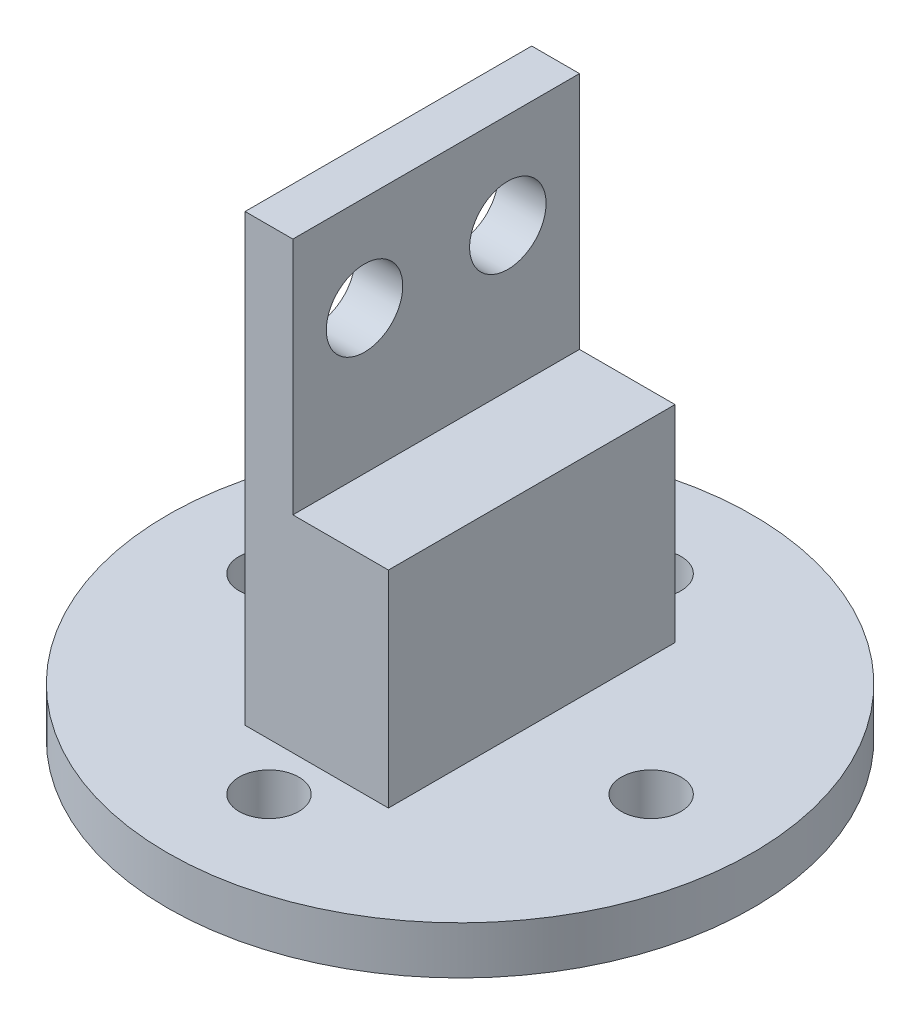
ISO-10303-21;
HEADER;
FILE_DESCRIPTION(('STEP AP214'),'2;1');
FILE_NAME('part.step','',(''),(''),'','','');
FILE_SCHEMA(('AUTOMOTIVE_DESIGN { 1 0 10303 214 1 1 1 1 }'));
ENDSEC;
DATA;
#1=APPLICATION_CONTEXT('core data for automotive mechanical design processes');
#2=APPLICATION_PROTOCOL_DEFINITION('international standard','automotive_design',2000,#1);
#3=PRODUCT_CONTEXT('',#1,'mechanical');
#4=PRODUCT('Part','Part','',(#3));
#5=PRODUCT_RELATED_PRODUCT_CATEGORY('part','',(#4));
#6=PRODUCT_DEFINITION_FORMATION('','',#4);
#7=PRODUCT_DEFINITION_CONTEXT('part definition',#1,'design');
#8=PRODUCT_DEFINITION('design','',#6,#7);
#9=PRODUCT_DEFINITION_SHAPE('','',#8);
#10=(LENGTH_UNIT() NAMED_UNIT(*) SI_UNIT(.MILLI.,.METRE.));
#11=(NAMED_UNIT(*) PLANE_ANGLE_UNIT() SI_UNIT($,.RADIAN.));
#12=(NAMED_UNIT(*) SI_UNIT($,.STERADIAN.) SOLID_ANGLE_UNIT());
#13=UNCERTAINTY_MEASURE_WITH_UNIT(LENGTH_MEASURE(1.E-05),#10,'distance_accuracy_value','');
#14=(GEOMETRIC_REPRESENTATION_CONTEXT(3) GLOBAL_UNCERTAINTY_ASSIGNED_CONTEXT((#13)) GLOBAL_UNIT_ASSIGNED_CONTEXT((#10,
#11,#12)) REPRESENTATION_CONTEXT('',''));
#15=CARTESIAN_POINT('',(0.,0.,0.));
#16=DIRECTION('',(0.,0.,1.));
#17=DIRECTION('',(1.,0.,0.));
#18=AXIS2_PLACEMENT_3D('',#15,#16,#17);
#19=CARTESIAN_POINT('',(0.,2.,0.));
#20=DIRECTION('',(0.,1.,0.));
#21=DIRECTION('',(0.,0.,1.));
#22=AXIS2_PLACEMENT_3D('',#19,#20,#21);
#23=PLANE('',#22);
#24=CARTESIAN_POINT('',(-8.,2.,0.));
#25=DIRECTION('',(0.,1.,0.));
#26=DIRECTION('',(0.,0.,1.));
#27=AXIS2_PLACEMENT_3D('',#24,#25,#26);
#28=CIRCLE('',#27,1.25);
#29=CARTESIAN_POINT('',(-8.,2.,1.24999999999994));
#30=VERTEX_POINT('',#29);
#31=EDGE_CURVE('E182',#30,#30,#28,.T.);
#32=ORIENTED_EDGE('',*,*,#31,.F.);
#33=EDGE_LOOP('',(#32));
#34=FACE_BOUND('',#33,.T.);
#35=CARTESIAN_POINT('',(8.,2.,0.));
#36=DIRECTION('',(0.,1.,0.));
#37=DIRECTION('',(0.,0.,1.));
#38=AXIS2_PLACEMENT_3D('',#35,#36,#37);
#39=CIRCLE('',#38,1.25);
#40=CARTESIAN_POINT('',(8.,2.,1.25));
#41=VERTEX_POINT('',#40);
#42=EDGE_CURVE('E198',#41,#41,#39,.T.);
#43=ORIENTED_EDGE('',*,*,#42,.F.);
#44=EDGE_LOOP('',(#43));
#45=FACE_BOUND('',#44,.T.);
#46=CARTESIAN_POINT('',(0.,2.,0.));
#47=DIRECTION('',(0.,1.,0.));
#48=DIRECTION('',(0.,0.,1.));
#49=AXIS2_PLACEMENT_3D('',#46,#47,#48);
#50=CIRCLE('',#49,12.25);
#51=CARTESIAN_POINT('',(0.,2.,12.25));
#52=VERTEX_POINT('',#51);
#53=EDGE_CURVE('E11',#52,#52,#50,.T.);
#54=ORIENTED_EDGE('',*,*,#53,.T.);
#55=EDGE_LOOP('',(#54));
#56=FACE_BOUND('',#55,.T.);
#57=CARTESIAN_POINT('',(0.,2.,8.));
#58=DIRECTION('',(0.,1.,0.));
#59=DIRECTION('',(0.,0.,1.));
#60=AXIS2_PLACEMENT_3D('',#57,#58,#59);
#61=CIRCLE('',#60,1.25);
#62=CARTESIAN_POINT('',(0.,2.,9.25));
#63=VERTEX_POINT('',#62);
#64=EDGE_CURVE('E190',#63,#63,#61,.T.);
#65=ORIENTED_EDGE('',*,*,#64,.F.);
#66=EDGE_LOOP('',(#65));
#67=FACE_BOUND('',#66,.T.);
#68=CARTESIAN_POINT('',(0.,2.,-8.));
#69=DIRECTION('',(0.,1.,0.));
#70=DIRECTION('',(0.,0.,1.));
#71=AXIS2_PLACEMENT_3D('',#68,#69,#70);
#72=CIRCLE('',#71,1.25);
#73=CARTESIAN_POINT('',(0.,2.,-6.75));
#74=VERTEX_POINT('',#73);
#75=EDGE_CURVE('E174',#74,#74,#72,.T.);
#76=ORIENTED_EDGE('',*,*,#75,.F.);
#77=EDGE_LOOP('',(#76));
#78=FACE_BOUND('',#77,.T.);
#79=DIRECTION('',(0.,0.,1.));
#80=VECTOR('',#79,1.);
#81=CARTESIAN_POINT('',(-3.,2.,6.));
#82=LINE('',#81,#80);
#83=CARTESIAN_POINT('',(-3.,2.,-6.));
#84=VERTEX_POINT('',#83);
#85=CARTESIAN_POINT('',(-3.,2.,6.));
#86=VERTEX_POINT('',#85);
#87=EDGE_CURVE('E130',#84,#86,#82,.T.);
#88=ORIENTED_EDGE('',*,*,#87,.F.);
#89=DIRECTION('',(-1.,0.,0.));
#90=VECTOR('',#89,1.);
#91=CARTESIAN_POINT('',(-3.,2.,-6.));
#92=LINE('',#91,#90);
#93=CARTESIAN_POINT('',(3.,2.,-6.));
#94=VERTEX_POINT('',#93);
#95=EDGE_CURVE('E126',#94,#84,#92,.T.);
#96=ORIENTED_EDGE('',*,*,#95,.F.);
#97=DIRECTION('',(0.,0.,-1.));
#98=VECTOR('',#97,1.);
#99=CARTESIAN_POINT('',(3.,2.,-6.));
#100=LINE('',#99,#98);
#101=CARTESIAN_POINT('',(3.,2.,6.));
#102=VERTEX_POINT('',#101);
#103=EDGE_CURVE('E137',#102,#94,#100,.T.);
#104=ORIENTED_EDGE('',*,*,#103,.F.);
#105=DIRECTION('',(1.,0.,0.));
#106=VECTOR('',#105,1.);
#107=CARTESIAN_POINT('',(-3.,2.,6.));
#108=LINE('',#107,#106);
#109=EDGE_CURVE('E134',#86,#102,#108,.T.);
#110=ORIENTED_EDGE('',*,*,#109,.F.);
#111=EDGE_LOOP('',(#88,#96,#104,#110));
#112=FACE_BOUND('',#111,.T.);
#113=ADVANCED_FACE('F38',(#34,#45,#56,#67,#78,#112),#23,.T.);
#114=CARTESIAN_POINT('',(0.,0.,0.));
#115=DIRECTION('',(0.,1.,0.));
#116=DIRECTION('',(0.,0.,1.));
#117=AXIS2_PLACEMENT_3D('',#114,#115,#116);
#118=PLANE('',#117);
#119=CARTESIAN_POINT('',(0.,0.,0.));
#120=DIRECTION('',(0.,1.,0.));
#121=DIRECTION('',(0.,0.,1.));
#122=AXIS2_PLACEMENT_3D('',#119,#120,#121);
#123=CIRCLE('',#122,12.25);
#124=CARTESIAN_POINT('',(0.,0.,12.25));
#125=VERTEX_POINT('',#124);
#126=EDGE_CURVE('E48',#125,#125,#123,.T.);
#127=ORIENTED_EDGE('',*,*,#126,.F.);
#128=EDGE_LOOP('',(#127));
#129=FACE_BOUND('',#128,.T.);
#130=CARTESIAN_POINT('',(8.,0.,0.));
#131=DIRECTION('',(0.,1.,0.));
#132=DIRECTION('',(0.,0.,1.));
#133=AXIS2_PLACEMENT_3D('',#130,#131,#132);
#134=CIRCLE('',#133,1.25);
#135=CARTESIAN_POINT('',(8.,0.,1.25));
#136=VERTEX_POINT('',#135);
#137=EDGE_CURVE('E194',#136,#136,#134,.T.);
#138=ORIENTED_EDGE('',*,*,#137,.T.);
#139=EDGE_LOOP('',(#138));
#140=FACE_BOUND('',#139,.T.);
#141=CARTESIAN_POINT('',(0.,0.,8.));
#142=DIRECTION('',(0.,1.,0.));
#143=DIRECTION('',(0.,0.,1.));
#144=AXIS2_PLACEMENT_3D('',#141,#142,#143);
#145=CIRCLE('',#144,1.25);
#146=CARTESIAN_POINT('',(0.,0.,9.25));
#147=VERTEX_POINT('',#146);
#148=EDGE_CURVE('E186',#147,#147,#145,.T.);
#149=ORIENTED_EDGE('',*,*,#148,.T.);
#150=EDGE_LOOP('',(#149));
#151=FACE_BOUND('',#150,.T.);
#152=CARTESIAN_POINT('',(-8.,0.,0.));
#153=DIRECTION('',(0.,1.,0.));
#154=DIRECTION('',(0.,0.,1.));
#155=AXIS2_PLACEMENT_3D('',#152,#153,#154);
#156=CIRCLE('',#155,1.25);
#157=CARTESIAN_POINT('',(-8.,0.,1.24999999999994));
#158=VERTEX_POINT('',#157);
#159=EDGE_CURVE('E178',#158,#158,#156,.T.);
#160=ORIENTED_EDGE('',*,*,#159,.T.);
#161=EDGE_LOOP('',(#160));
#162=FACE_BOUND('',#161,.T.);
#163=CARTESIAN_POINT('',(0.,0.,-8.));
#164=DIRECTION('',(0.,1.,0.));
#165=DIRECTION('',(0.,0.,1.));
#166=AXIS2_PLACEMENT_3D('',#163,#164,#165);
#167=CIRCLE('',#166,1.25);
#168=CARTESIAN_POINT('',(0.,0.,-6.75));
#169=VERTEX_POINT('',#168);
#170=EDGE_CURVE('E173',#169,#169,#167,.T.);
#171=ORIENTED_EDGE('',*,*,#170,.T.);
#172=EDGE_LOOP('',(#171));
#173=FACE_BOUND('',#172,.T.);
#174=ADVANCED_FACE('F233',(#129,#140,#151,#162,#173),#118,.F.);
#175=CARTESIAN_POINT('',(0.,2.,0.));
#176=DIRECTION('',(0.,-1.,0.));
#177=DIRECTION('',(0.,0.,-1.));
#178=AXIS2_PLACEMENT_3D('',#175,#176,#177);
#179=CYLINDRICAL_SURFACE('',#178,12.25);
#180=ORIENTED_EDGE('',*,*,#53,.F.);
#181=EDGE_LOOP('',(#180));
#182=FACE_BOUND('',#181,.T.);
#183=ORIENTED_EDGE('',*,*,#126,.T.);
#184=EDGE_LOOP('',(#183));
#185=FACE_BOUND('',#184,.T.);
#186=ADVANCED_FACE('F40',(#182,#185),#179,.T.);
#187=CARTESIAN_POINT('',(8.,2.,0.));
#188=DIRECTION('',(0.,-1.,0.));
#189=DIRECTION('',(0.,0.,-1.));
#190=AXIS2_PLACEMENT_3D('',#187,#188,#189);
#191=CYLINDRICAL_SURFACE('',#190,1.25);
#192=ORIENTED_EDGE('',*,*,#42,.T.);
#193=EDGE_LOOP('',(#192));
#194=FACE_BOUND('',#193,.T.);
#195=ORIENTED_EDGE('',*,*,#137,.F.);
#196=EDGE_LOOP('',(#195));
#197=FACE_BOUND('',#196,.T.);
#198=ADVANCED_FACE('F244',(#194,#197),#191,.F.);
#199=CARTESIAN_POINT('',(0.,2.,8.));
#200=DIRECTION('',(0.,-1.,0.));
#201=DIRECTION('',(0.,0.,-1.));
#202=AXIS2_PLACEMENT_3D('',#199,#200,#201);
#203=CYLINDRICAL_SURFACE('',#202,1.25);
#204=ORIENTED_EDGE('',*,*,#64,.T.);
#205=EDGE_LOOP('',(#204));
#206=FACE_BOUND('',#205,.T.);
#207=ORIENTED_EDGE('',*,*,#148,.F.);
#208=EDGE_LOOP('',(#207));
#209=FACE_BOUND('',#208,.T.);
#210=ADVANCED_FACE('F247',(#206,#209),#203,.F.);
#211=CARTESIAN_POINT('',(-8.,2.,0.));
#212=DIRECTION('',(0.,-1.,0.));
#213=DIRECTION('',(0.,0.,-1.));
#214=AXIS2_PLACEMENT_3D('',#211,#212,#213);
#215=CYLINDRICAL_SURFACE('',#214,1.25);
#216=ORIENTED_EDGE('',*,*,#31,.T.);
#217=EDGE_LOOP('',(#216));
#218=FACE_BOUND('',#217,.T.);
#219=ORIENTED_EDGE('',*,*,#159,.F.);
#220=EDGE_LOOP('',(#219));
#221=FACE_BOUND('',#220,.T.);
#222=ADVANCED_FACE('F251',(#218,#221),#215,.F.);
#223=CARTESIAN_POINT('',(0.,2.,-8.));
#224=DIRECTION('',(0.,-1.,0.));
#225=DIRECTION('',(0.,0.,-1.));
#226=AXIS2_PLACEMENT_3D('',#223,#224,#225);
#227=CYLINDRICAL_SURFACE('',#226,1.25);
#228=ORIENTED_EDGE('',*,*,#75,.T.);
#229=EDGE_LOOP('',(#228));
#230=FACE_BOUND('',#229,.T.);
#231=ORIENTED_EDGE('',*,*,#170,.F.);
#232=EDGE_LOOP('',(#231));
#233=FACE_BOUND('',#232,.T.);
#234=ADVANCED_FACE('F255',(#230,#233),#227,.F.);
#235=CARTESIAN_POINT('',(3.,12.63,-6.));
#236=DIRECTION('',(-1.,0.,0.));
#237=DIRECTION('',(0.,0.,1.));
#238=AXIS2_PLACEMENT_3D('',#235,#236,#237);
#239=PLANE('',#238);
#240=DIRECTION('',(0.,-1.,0.));
#241=VECTOR('',#240,1.);
#242=CARTESIAN_POINT('',(3.,12.63,-6.));
#243=LINE('',#242,#241);
#244=CARTESIAN_POINT('',(3.,10.63,-6.));
#245=VERTEX_POINT('',#244);
#246=EDGE_CURVE('E140',#245,#94,#243,.T.);
#247=ORIENTED_EDGE('',*,*,#246,.F.);
#248=DIRECTION('',(0.,0.,-1.));
#249=VECTOR('',#248,1.);
#250=CARTESIAN_POINT('',(3.,10.63,-6.));
#251=LINE('',#250,#249);
#252=CARTESIAN_POINT('',(3.,10.63,6.));
#253=VERTEX_POINT('',#252);
#254=EDGE_CURVE('E119',#253,#245,#251,.T.);
#255=ORIENTED_EDGE('',*,*,#254,.F.);
#256=DIRECTION('',(0.,-1.,0.));
#257=VECTOR('',#256,1.);
#258=CARTESIAN_POINT('',(3.,12.63,6.));
#259=LINE('',#258,#257);
#260=EDGE_CURVE('E56',#253,#102,#259,.T.);
#261=ORIENTED_EDGE('',*,*,#260,.T.);
#262=ORIENTED_EDGE('',*,*,#103,.T.);
#263=EDGE_LOOP('',(#247,#255,#261,#262));
#264=FACE_BOUND('',#263,.T.);
#265=ADVANCED_FACE('F228',(#264),#239,.F.);
#266=CARTESIAN_POINT('',(-11.,16.63,3.));
#267=DIRECTION('',(1.,0.,0.));
#268=DIRECTION('',(0.,0.,-1.));
#269=AXIS2_PLACEMENT_3D('',#266,#267,#268);
#270=CYLINDRICAL_SURFACE('',#269,1.6);
#271=CARTESIAN_POINT('',(-1.,16.63,3.));
#272=DIRECTION('',(1.,0.,0.));
#273=DIRECTION('',(0.,0.,1.));
#274=AXIS2_PLACEMENT_3D('',#271,#272,#273);
#275=CIRCLE('',#274,1.6);
#276=CARTESIAN_POINT('',(-1.,16.63,4.6));
#277=VERTEX_POINT('',#276);
#278=EDGE_CURVE('E145',#277,#277,#275,.T.);
#279=ORIENTED_EDGE('',*,*,#278,.T.);
#280=EDGE_LOOP('',(#279));
#281=FACE_BOUND('',#280,.T.);
#282=CARTESIAN_POINT('',(-3.,16.63,3.));
#283=DIRECTION('',(1.,0.,0.));
#284=DIRECTION('',(0.,0.,-1.));
#285=AXIS2_PLACEMENT_3D('',#282,#283,#284);
#286=CIRCLE('',#285,1.6);
#287=CARTESIAN_POINT('',(-3.,16.63,1.4));
#288=VERTEX_POINT('',#287);
#289=EDGE_CURVE('E150',#288,#288,#286,.T.);
#290=ORIENTED_EDGE('',*,*,#289,.F.);
#291=EDGE_LOOP('',(#290));
#292=FACE_BOUND('',#291,.T.);
#293=ADVANCED_FACE('F220',(#281,#292),#270,.F.);
#294=CARTESIAN_POINT('',(-11.,16.63,-3.));
#295=DIRECTION('',(1.,0.,0.));
#296=DIRECTION('',(0.,0.,-1.));
#297=AXIS2_PLACEMENT_3D('',#294,#295,#296);
#298=CYLINDRICAL_SURFACE('',#297,1.6);
#299=CARTESIAN_POINT('',(-1.,16.63,-3.));
#300=DIRECTION('',(1.,0.,0.));
#301=DIRECTION('',(0.,0.,-1.));
#302=AXIS2_PLACEMENT_3D('',#299,#300,#301);
#303=CIRCLE('',#302,1.6);
#304=CARTESIAN_POINT('',(-1.,16.63,-4.6));
#305=VERTEX_POINT('',#304);
#306=EDGE_CURVE('E146',#305,#305,#303,.T.);
#307=ORIENTED_EDGE('',*,*,#306,.T.);
#308=EDGE_LOOP('',(#307));
#309=FACE_BOUND('',#308,.T.);
#310=CARTESIAN_POINT('',(-3.,16.63,-3.));
#311=DIRECTION('',(1.,0.,0.));
#312=DIRECTION('',(0.,0.,-1.));
#313=AXIS2_PLACEMENT_3D('',#310,#311,#312);
#314=CIRCLE('',#313,1.6);
#315=CARTESIAN_POINT('',(-3.,16.63,-4.6));
#316=VERTEX_POINT('',#315);
#317=EDGE_CURVE('E42',#316,#316,#314,.T.);
#318=ORIENTED_EDGE('',*,*,#317,.F.);
#319=EDGE_LOOP('',(#318));
#320=FACE_BOUND('',#319,.T.);
#321=ADVANCED_FACE('F217',(#309,#320),#298,.F.);
#322=CARTESIAN_POINT('',(0.,20.63,0.));
#323=DIRECTION('',(0.,-1.,0.));
#324=DIRECTION('',(0.,0.,-1.));
#325=AXIS2_PLACEMENT_3D('',#322,#323,#324);
#326=PLANE('',#325);
#327=DIRECTION('',(0.,0.,-1.));
#328=VECTOR('',#327,1.);
#329=CARTESIAN_POINT('',(-1.,20.63,-6.));
#330=LINE('',#329,#328);
#331=CARTESIAN_POINT('',(-1.,20.63,6.));
#332=VERTEX_POINT('',#331);
#333=CARTESIAN_POINT('',(-1.,20.63,-6.));
#334=VERTEX_POINT('',#333);
#335=EDGE_CURVE('E103',#332,#334,#330,.T.);
#336=ORIENTED_EDGE('',*,*,#335,.T.);
#337=DIRECTION('',(-1.,0.,0.));
#338=VECTOR('',#337,1.);
#339=CARTESIAN_POINT('',(-3.,20.63,-6.));
#340=LINE('',#339,#338);
#341=CARTESIAN_POINT('',(-3.,20.63,-6.));
#342=VERTEX_POINT('',#341);
#343=EDGE_CURVE('E156',#334,#342,#340,.T.);
#344=ORIENTED_EDGE('',*,*,#343,.T.);
#345=DIRECTION('',(0.,0.,1.));
#346=VECTOR('',#345,1.);
#347=CARTESIAN_POINT('',(-3.,20.63,6.));
#348=LINE('',#347,#346);
#349=CARTESIAN_POINT('',(-3.,20.63,6.));
#350=VERTEX_POINT('',#349);
#351=EDGE_CURVE('E159',#342,#350,#348,.T.);
#352=ORIENTED_EDGE('',*,*,#351,.T.);
#353=DIRECTION('',(1.,0.,0.));
#354=VECTOR('',#353,1.);
#355=CARTESIAN_POINT('',(-1.,20.63,6.));
#356=LINE('',#355,#354);
#357=EDGE_CURVE('E64',#350,#332,#356,.T.);
#358=ORIENTED_EDGE('',*,*,#357,.T.);
#359=EDGE_LOOP('',(#336,#344,#352,#358));
#360=FACE_BOUND('',#359,.T.);
#361=ADVANCED_FACE('F219',(#360),#326,.F.);
#362=CARTESIAN_POINT('',(-1.,20.63,6.));
#363=DIRECTION('',(0.,0.,-1.));
#364=DIRECTION('',(-1.,0.,0.));
#365=AXIS2_PLACEMENT_3D('',#362,#363,#364);
#366=PLANE('',#365);
#367=DIRECTION('',(1.,0.,0.));
#368=VECTOR('',#367,1.);
#369=CARTESIAN_POINT('',(3.,10.63,6.));
#370=LINE('',#369,#368);
#371=CARTESIAN_POINT('',(-1.,10.63,6.));
#372=VERTEX_POINT('',#371);
#373=EDGE_CURVE('E111',#372,#253,#370,.T.);
#374=ORIENTED_EDGE('',*,*,#373,.F.);
#375=DIRECTION('',(0.,-1.,0.));
#376=VECTOR('',#375,1.);
#377=CARTESIAN_POINT('',(-1.,20.63,6.));
#378=LINE('',#377,#376);
#379=EDGE_CURVE('E97',#332,#372,#378,.T.);
#380=ORIENTED_EDGE('',*,*,#379,.F.);
#381=ORIENTED_EDGE('',*,*,#357,.F.);
#382=DIRECTION('',(0.,-1.,0.));
#383=VECTOR('',#382,1.);
#384=CARTESIAN_POINT('',(-3.,20.63,6.));
#385=LINE('',#384,#383);
#386=EDGE_CURVE('E107',#350,#86,#385,.T.);
#387=ORIENTED_EDGE('',*,*,#386,.T.);
#388=ORIENTED_EDGE('',*,*,#109,.T.);
#389=ORIENTED_EDGE('',*,*,#260,.F.);
#390=EDGE_LOOP('',(#374,#380,#381,#387,#388,#389));
#391=FACE_BOUND('',#390,.T.);
#392=ADVANCED_FACE('F116',(#391),#366,.F.);
#393=CARTESIAN_POINT('',(-3.,20.63,6.));
#394=DIRECTION('',(1.,0.,0.));
#395=DIRECTION('',(0.,0.,-1.));
#396=AXIS2_PLACEMENT_3D('',#393,#394,#395);
#397=PLANE('',#396);
#398=DIRECTION('',(0.,-1.,0.));
#399=VECTOR('',#398,1.);
#400=CARTESIAN_POINT('',(-3.,20.63,-6.));
#401=LINE('',#400,#399);
#402=EDGE_CURVE('E166',#342,#84,#401,.T.);
#403=ORIENTED_EDGE('',*,*,#402,.T.);
#404=ORIENTED_EDGE('',*,*,#87,.T.);
#405=ORIENTED_EDGE('',*,*,#386,.F.);
#406=ORIENTED_EDGE('',*,*,#351,.F.);
#407=EDGE_LOOP('',(#403,#404,#405,#406));
#408=FACE_BOUND('',#407,.T.);
#409=ORIENTED_EDGE('',*,*,#317,.T.);
#410=EDGE_LOOP('',(#409));
#411=FACE_BOUND('',#410,.T.);
#412=ORIENTED_EDGE('',*,*,#289,.T.);
#413=EDGE_LOOP('',(#412));
#414=FACE_BOUND('',#413,.T.);
#415=ADVANCED_FACE('F215',(#408,#411,#414),#397,.F.);
#416=CARTESIAN_POINT('',(-3.,20.63,-6.));
#417=DIRECTION('',(0.,0.,1.));
#418=DIRECTION('',(1.,0.,0.));
#419=AXIS2_PLACEMENT_3D('',#416,#417,#418);
#420=PLANE('',#419);
#421=DIRECTION('',(0.,-1.,0.));
#422=VECTOR('',#421,1.);
#423=CARTESIAN_POINT('',(-1.,20.63,-6.));
#424=LINE('',#423,#422);
#425=CARTESIAN_POINT('',(-1.,10.63,-6.));
#426=VERTEX_POINT('',#425);
#427=EDGE_CURVE('E170',#334,#426,#424,.T.);
#428=ORIENTED_EDGE('',*,*,#427,.T.);
#429=DIRECTION('',(-1.,0.,0.));
#430=VECTOR('',#429,1.);
#431=CARTESIAN_POINT('',(-1.,10.63,-6.));
#432=LINE('',#431,#430);
#433=EDGE_CURVE('E113',#245,#426,#432,.T.);
#434=ORIENTED_EDGE('',*,*,#433,.F.);
#435=ORIENTED_EDGE('',*,*,#246,.T.);
#436=ORIENTED_EDGE('',*,*,#95,.T.);
#437=ORIENTED_EDGE('',*,*,#402,.F.);
#438=ORIENTED_EDGE('',*,*,#343,.F.);
#439=EDGE_LOOP('',(#428,#434,#435,#436,#437,#438));
#440=FACE_BOUND('',#439,.T.);
#441=ADVANCED_FACE('F262',(#440),#420,.F.);
#442=CARTESIAN_POINT('',(-1.,20.63,-6.));
#443=DIRECTION('',(-1.,0.,0.));
#444=DIRECTION('',(0.,0.,1.));
#445=AXIS2_PLACEMENT_3D('',#442,#443,#444);
#446=PLANE('',#445);
#447=ORIENTED_EDGE('',*,*,#306,.F.);
#448=EDGE_LOOP('',(#447));
#449=FACE_BOUND('',#448,.T.);
#450=ORIENTED_EDGE('',*,*,#278,.F.);
#451=EDGE_LOOP('',(#450));
#452=FACE_BOUND('',#451,.T.);
#453=ORIENTED_EDGE('',*,*,#379,.T.);
#454=DIRECTION('',(0.,0.,1.));
#455=VECTOR('',#454,1.);
#456=CARTESIAN_POINT('',(-1.,10.63,6.));
#457=LINE('',#456,#455);
#458=EDGE_CURVE('E101',#426,#372,#457,.T.);
#459=ORIENTED_EDGE('',*,*,#458,.F.);
#460=ORIENTED_EDGE('',*,*,#427,.F.);
#461=ORIENTED_EDGE('',*,*,#335,.F.);
#462=EDGE_LOOP('',(#453,#459,#460,#461));
#463=FACE_BOUND('',#462,.T.);
#464=ADVANCED_FACE('F99',(#449,#452,#463),#446,.F.);
#465=CARTESIAN_POINT('',(0.,10.63,0.));
#466=DIRECTION('',(0.,-1.,0.));
#467=DIRECTION('',(0.,0.,-1.));
#468=AXIS2_PLACEMENT_3D('',#465,#466,#467);
#469=PLANE('',#468);
#470=ORIENTED_EDGE('',*,*,#458,.T.);
#471=ORIENTED_EDGE('',*,*,#373,.T.);
#472=ORIENTED_EDGE('',*,*,#254,.T.);
#473=ORIENTED_EDGE('',*,*,#433,.T.);
#474=EDGE_LOOP('',(#470,#471,#472,#473));
#475=FACE_BOUND('',#474,.T.);
#476=ADVANCED_FACE('F110',(#475),#469,.F.);
#477=CLOSED_SHELL('',(#113,#174,#186,#198,#210,#222,#234,#265,#293,#321,#361,#392,#415,#441,
#464,#476));
#478=MANIFOLD_SOLID_BREP('B2',#477);
#479=ADVANCED_BREP_SHAPE_REPRESENTATION('',(#18,#478),#14);
#480=SHAPE_DEFINITION_REPRESENTATION(#9,#479);
ENDSEC;
END-ISO-10303-21;
